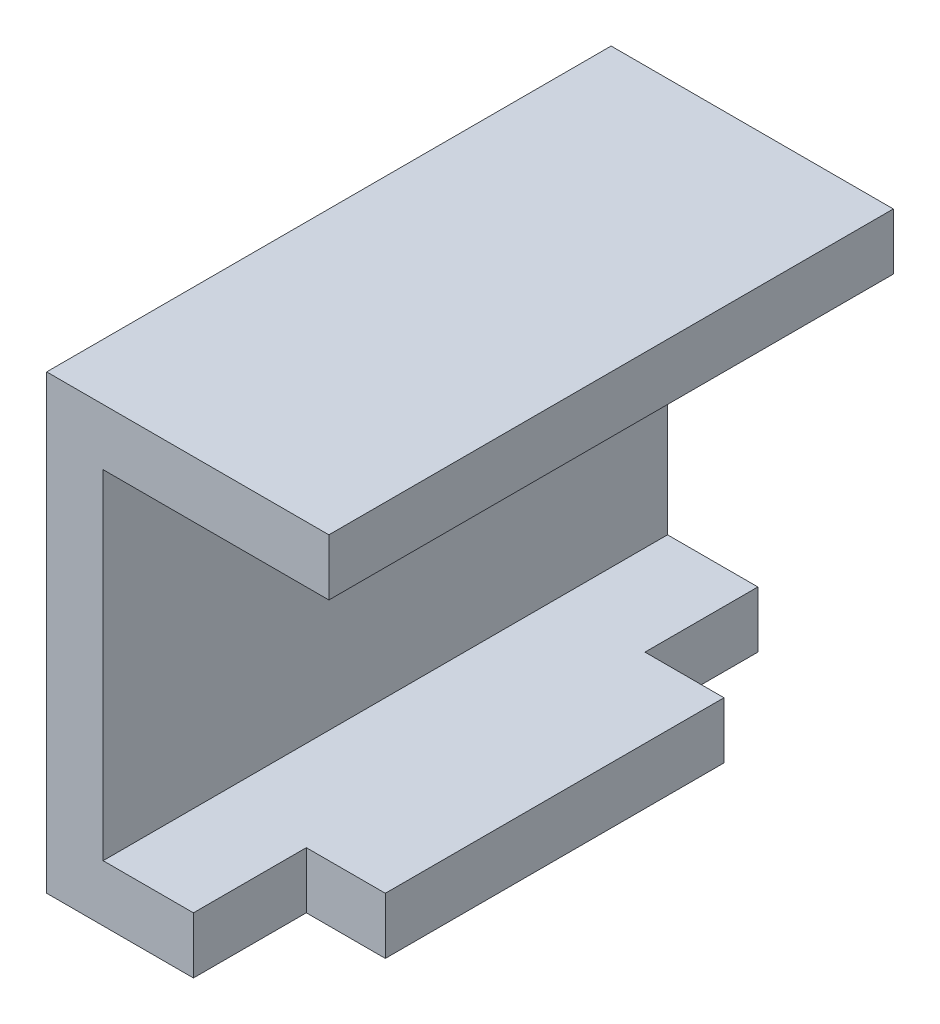
ISO-10303-21;
HEADER;
FILE_DESCRIPTION(('STEP AP214'),'2;1');
FILE_NAME('part.step','',(''),(''),'','','');
FILE_SCHEMA(('AUTOMOTIVE_DESIGN { 1 0 10303 214 1 1 1 1 }'));
ENDSEC;
DATA;
#1=APPLICATION_CONTEXT('core data for automotive mechanical design processes');
#2=APPLICATION_PROTOCOL_DEFINITION('international standard','automotive_design',2000,#1);
#3=PRODUCT_CONTEXT('',#1,'mechanical');
#4=PRODUCT('Part','Part','',(#3));
#5=PRODUCT_RELATED_PRODUCT_CATEGORY('part','',(#4));
#6=PRODUCT_DEFINITION_FORMATION('','',#4);
#7=PRODUCT_DEFINITION_CONTEXT('part definition',#1,'design');
#8=PRODUCT_DEFINITION('design','',#6,#7);
#9=PRODUCT_DEFINITION_SHAPE('','',#8);
#10=(LENGTH_UNIT() NAMED_UNIT(*) SI_UNIT(.MILLI.,.METRE.));
#11=(NAMED_UNIT(*) PLANE_ANGLE_UNIT() SI_UNIT($,.RADIAN.));
#12=(NAMED_UNIT(*) SI_UNIT($,.STERADIAN.) SOLID_ANGLE_UNIT());
#13=UNCERTAINTY_MEASURE_WITH_UNIT(LENGTH_MEASURE(1.E-05),#10,'distance_accuracy_value','');
#14=(GEOMETRIC_REPRESENTATION_CONTEXT(3) GLOBAL_UNCERTAINTY_ASSIGNED_CONTEXT((#13)) GLOBAL_UNIT_ASSIGNED_CONTEXT((#10,
#11,#12)) REPRESENTATION_CONTEXT('',''));
#15=CARTESIAN_POINT('',(0.,0.,0.));
#16=DIRECTION('',(0.,0.,1.));
#17=DIRECTION('',(1.,0.,0.));
#18=AXIS2_PLACEMENT_3D('',#15,#16,#17);
#19=CARTESIAN_POINT('',(0.01333332782721,0.,0.4));
#20=DIRECTION('',(0.,0.,-1.));
#21=DIRECTION('',(0.,-1.,0.));
#22=AXIS2_PLACEMENT_3D('',#19,#20,#21);
#23=PLANE('',#22);
#24=DIRECTION('',(1.,0.,0.));
#25=VECTOR('',#24,1.);
#26=CARTESIAN_POINT('',(0.01333332782721,0.05,0.4));
#27=LINE('',#26,#25);
#28=CARTESIAN_POINT('',(-0.05666667217279,0.05,0.4));
#29=VERTEX_POINT('',#28);
#30=CARTESIAN_POINT('',(0.01333332782721,0.05,0.4));
#31=VERTEX_POINT('',#30);
#32=EDGE_CURVE('E41',#29,#31,#27,.T.);
#33=ORIENTED_EDGE('',*,*,#32,.F.);
#34=DIRECTION('',(0.,1.,0.));
#35=VECTOR('',#34,1.);
#36=CARTESIAN_POINT('',(-0.05666667217279,0.,0.4));
#37=LINE('',#36,#35);
#38=CARTESIAN_POINT('',(-0.05666667217279,0.,0.4));
#39=VERTEX_POINT('',#38);
#40=EDGE_CURVE('E11',#39,#29,#37,.T.);
#41=ORIENTED_EDGE('',*,*,#40,.F.);
#42=DIRECTION('',(-1.,0.,0.));
#43=VECTOR('',#42,1.);
#44=CARTESIAN_POINT('',(-0.08666667217279,0.,0.4));
#45=LINE('',#44,#43);
#46=CARTESIAN_POINT('',(0.01333332782721,0.,0.4));
#47=VERTEX_POINT('',#46);
#48=EDGE_CURVE('E154',#47,#39,#45,.T.);
#49=ORIENTED_EDGE('',*,*,#48,.F.);
#50=DIRECTION('',(0.,-1.,0.));
#51=VECTOR('',#50,1.);
#52=CARTESIAN_POINT('',(0.01333332782721,0.,0.4));
#53=LINE('',#52,#51);
#54=EDGE_CURVE('E197',#31,#47,#53,.T.);
#55=ORIENTED_EDGE('',*,*,#54,.F.);
#56=EDGE_LOOP('',(#33,#41,#49,#55));
#57=FACE_BOUND('',#56,.T.);
#58=ADVANCED_FACE('F17',(#57),#23,.F.);
#59=CARTESIAN_POINT('',(-0.05666667217279,0.,0.4));
#60=DIRECTION('',(-1.,0.,0.));
#61=DIRECTION('',(0.,1.,0.));
#62=AXIS2_PLACEMENT_3D('',#59,#60,#61);
#63=PLANE('',#62);
#64=DIRECTION('',(0.,0.,-1.));
#65=VECTOR('',#64,1.);
#66=CARTESIAN_POINT('',(-0.05666667217279,0.05,0.2));
#67=LINE('',#66,#65);
#68=CARTESIAN_POINT('',(-0.05666667217279,0.05,0.5));
#69=VERTEX_POINT('',#68);
#70=EDGE_CURVE('E201',#69,#29,#67,.T.);
#71=ORIENTED_EDGE('',*,*,#70,.F.);
#72=DIRECTION('',(0.,1.,0.));
#73=VECTOR('',#72,1.);
#74=CARTESIAN_POINT('',(-0.05666667217279,0.10546875,0.5));
#75=LINE('',#74,#73);
#76=CARTESIAN_POINT('',(-0.05666667217279,0.,0.5));
#77=VERTEX_POINT('',#76);
#78=EDGE_CURVE('E217',#77,#69,#75,.T.);
#79=ORIENTED_EDGE('',*,*,#78,.F.);
#80=DIRECTION('',(0.,0.,1.));
#81=VECTOR('',#80,1.);
#82=CARTESIAN_POINT('',(-0.05666667217279,0.,0.2));
#83=LINE('',#82,#81);
#84=EDGE_CURVE('E21',#39,#77,#83,.T.);
#85=ORIENTED_EDGE('',*,*,#84,.F.);
#86=ORIENTED_EDGE('',*,*,#40,.T.);
#87=EDGE_LOOP('',(#71,#79,#85,#86));
#88=FACE_BOUND('',#87,.T.);
#89=ADVANCED_FACE('F303',(#88),#63,.F.);
#90=CARTESIAN_POINT('',(-0.05666667217279,0.,0.1));
#91=DIRECTION('',(0.,0.,1.));
#92=DIRECTION('',(1.,0.,0.));
#93=AXIS2_PLACEMENT_3D('',#90,#91,#92);
#94=PLANE('',#93);
#95=DIRECTION('',(-1.,0.,0.));
#96=VECTOR('',#95,1.);
#97=CARTESIAN_POINT('',(-0.02166667217279,0.05,0.1));
#98=LINE('',#97,#96);
#99=CARTESIAN_POINT('',(0.01333332782721,0.05,0.1));
#100=VERTEX_POINT('',#99);
#101=CARTESIAN_POINT('',(-0.05666667217279,0.05,0.1));
#102=VERTEX_POINT('',#101);
#103=EDGE_CURVE('E228',#100,#102,#98,.T.);
#104=ORIENTED_EDGE('',*,*,#103,.F.);
#105=DIRECTION('',(0.,1.,0.));
#106=VECTOR('',#105,1.);
#107=CARTESIAN_POINT('',(0.01333332782721,0.,0.1));
#108=LINE('',#107,#106);
#109=CARTESIAN_POINT('',(0.01333332782721,0.,0.1));
#110=VERTEX_POINT('',#109);
#111=EDGE_CURVE('E138',#110,#100,#108,.T.);
#112=ORIENTED_EDGE('',*,*,#111,.F.);
#113=DIRECTION('',(1.,0.,0.));
#114=VECTOR('',#113,1.);
#115=CARTESIAN_POINT('',(-0.121666672173,0.,0.1));
#116=LINE('',#115,#114);
#117=CARTESIAN_POINT('',(-0.05666667217279,0.,0.1));
#118=VERTEX_POINT('',#117);
#119=EDGE_CURVE('E133',#118,#110,#116,.T.);
#120=ORIENTED_EDGE('',*,*,#119,.F.);
#121=DIRECTION('',(0.,1.,0.));
#122=VECTOR('',#121,1.);
#123=CARTESIAN_POINT('',(-0.05666667217279,0.,0.1));
#124=LINE('',#123,#122);
#125=EDGE_CURVE('E28',#118,#102,#124,.T.);
#126=ORIENTED_EDGE('',*,*,#125,.T.);
#127=EDGE_LOOP('',(#104,#112,#120,#126));
#128=FACE_BOUND('',#127,.T.);
#129=ADVANCED_FACE('F135',(#128),#94,.F.);
#130=CARTESIAN_POINT('',(-0.05666667217279,0.,0.));
#131=DIRECTION('',(-1.,0.,0.));
#132=DIRECTION('',(0.,1.,0.));
#133=AXIS2_PLACEMENT_3D('',#130,#131,#132);
#134=PLANE('',#133);
#135=DIRECTION('',(0.,0.,-1.));
#136=VECTOR('',#135,1.);
#137=CARTESIAN_POINT('',(-0.05666667217279,0.05,0.));
#138=LINE('',#137,#136);
#139=CARTESIAN_POINT('',(-0.05666667217279,0.05,0.));
#140=VERTEX_POINT('',#139);
#141=EDGE_CURVE('E152',#102,#140,#138,.T.);
#142=ORIENTED_EDGE('',*,*,#141,.F.);
#143=ORIENTED_EDGE('',*,*,#125,.F.);
#144=DIRECTION('',(0.,0.,1.));
#145=VECTOR('',#144,1.);
#146=CARTESIAN_POINT('',(-0.05666667217279,0.,0.));
#147=LINE('',#146,#145);
#148=CARTESIAN_POINT('',(-0.05666667217279,0.,0.));
#149=VERTEX_POINT('',#148);
#150=EDGE_CURVE('E144',#149,#118,#147,.T.);
#151=ORIENTED_EDGE('',*,*,#150,.F.);
#152=DIRECTION('',(0.,-1.,0.));
#153=VECTOR('',#152,1.);
#154=CARTESIAN_POINT('',(-0.05666667217279,0.10546875,0.));
#155=LINE('',#154,#153);
#156=EDGE_CURVE('E210',#140,#149,#155,.T.);
#157=ORIENTED_EDGE('',*,*,#156,.F.);
#158=EDGE_LOOP('',(#142,#143,#151,#157));
#159=FACE_BOUND('',#158,.T.);
#160=ADVANCED_FACE('F149',(#159),#134,.F.);
#161=CARTESIAN_POINT('',(-0.186666672173,0.,0.));
#162=DIRECTION('',(0.,-1.,0.));
#163=DIRECTION('',(0.,0.,-1.));
#164=AXIS2_PLACEMENT_3D('',#161,#162,#163);
#165=PLANE('',#164);
#166=ORIENTED_EDGE('',*,*,#48,.T.);
#167=ORIENTED_EDGE('',*,*,#84,.T.);
#168=DIRECTION('',(1.,0.,0.));
#169=VECTOR('',#168,1.);
#170=CARTESIAN_POINT('',(-0.186666672173,0.,0.5));
#171=LINE('',#170,#169);
#172=CARTESIAN_POINT('',(-0.186666672173,0.,0.5));
#173=VERTEX_POINT('',#172);
#174=EDGE_CURVE('E213',#173,#77,#171,.T.);
#175=ORIENTED_EDGE('',*,*,#174,.F.);
#176=DIRECTION('',(0.,0.,1.));
#177=VECTOR('',#176,1.);
#178=CARTESIAN_POINT('',(-0.186666672173,0.,0.));
#179=LINE('',#178,#177);
#180=CARTESIAN_POINT('',(-0.186666672173,0.,0.));
#181=VERTEX_POINT('',#180);
#182=EDGE_CURVE('E174',#181,#173,#179,.T.);
#183=ORIENTED_EDGE('',*,*,#182,.F.);
#184=DIRECTION('',(1.,0.,0.));
#185=VECTOR('',#184,1.);
#186=CARTESIAN_POINT('',(-0.186666672173,0.,0.));
#187=LINE('',#186,#185);
#188=EDGE_CURVE('E158',#181,#149,#187,.T.);
#189=ORIENTED_EDGE('',*,*,#188,.T.);
#190=ORIENTED_EDGE('',*,*,#150,.T.);
#191=ORIENTED_EDGE('',*,*,#119,.T.);
#192=DIRECTION('',(0.,0.,1.));
#193=VECTOR('',#192,1.);
#194=CARTESIAN_POINT('',(0.01333332782721,0.,0.));
#195=LINE('',#194,#193);
#196=EDGE_CURVE('E145',#110,#47,#195,.T.);
#197=ORIENTED_EDGE('',*,*,#196,.T.);
#198=EDGE_LOOP('',(#166,#167,#175,#183,#189,#190,#191,#197));
#199=FACE_BOUND('',#198,.T.);
#200=ADVANCED_FACE('F156',(#199),#165,.T.);
#201=CARTESIAN_POINT('',(0.01333332782721,0.,0.));
#202=DIRECTION('',(1.,0.,0.));
#203=DIRECTION('',(0.,1.,0.));
#204=AXIS2_PLACEMENT_3D('',#201,#202,#203);
#205=PLANE('',#204);
#206=ORIENTED_EDGE('',*,*,#54,.T.);
#207=ORIENTED_EDGE('',*,*,#196,.F.);
#208=ORIENTED_EDGE('',*,*,#111,.T.);
#209=DIRECTION('',(0.,0.,1.));
#210=VECTOR('',#209,1.);
#211=CARTESIAN_POINT('',(0.01333332782721,0.05,0.));
#212=LINE('',#211,#210);
#213=EDGE_CURVE('E190',#100,#31,#212,.T.);
#214=ORIENTED_EDGE('',*,*,#213,.T.);
#215=EDGE_LOOP('',(#206,#207,#208,#214));
#216=FACE_BOUND('',#215,.T.);
#217=ADVANCED_FACE('F306',(#216),#205,.T.);
#218=CARTESIAN_POINT('',(0.06333332782721,0.35,0.));
#219=DIRECTION('',(1.,0.,0.));
#220=DIRECTION('',(0.,1.,0.));
#221=AXIS2_PLACEMENT_3D('',#218,#219,#220);
#222=PLANE('',#221);
#223=DIRECTION('',(0.,1.,0.));
#224=VECTOR('',#223,1.);
#225=CARTESIAN_POINT('',(0.06333332782721,0.35,0.));
#226=LINE('',#225,#224);
#227=CARTESIAN_POINT('',(0.06333332782721,0.35,0.));
#228=VERTEX_POINT('',#227);
#229=CARTESIAN_POINT('',(0.06333332782721,0.4,0.));
#230=VERTEX_POINT('',#229);
#231=EDGE_CURVE('E186',#228,#230,#226,.T.);
#232=ORIENTED_EDGE('',*,*,#231,.T.);
#233=DIRECTION('',(0.,0.,1.));
#234=VECTOR('',#233,1.);
#235=CARTESIAN_POINT('',(0.06333332782721,0.4,0.));
#236=LINE('',#235,#234);
#237=CARTESIAN_POINT('',(0.06333332782721,0.4,0.5));
#238=VERTEX_POINT('',#237);
#239=EDGE_CURVE('E184',#230,#238,#236,.T.);
#240=ORIENTED_EDGE('',*,*,#239,.T.);
#241=DIRECTION('',(0.,1.,0.));
#242=VECTOR('',#241,1.);
#243=CARTESIAN_POINT('',(0.06333332782721,0.35,0.5));
#244=LINE('',#243,#242);
#245=CARTESIAN_POINT('',(0.06333332782721,0.35,0.5));
#246=VERTEX_POINT('',#245);
#247=EDGE_CURVE('E170',#246,#238,#244,.T.);
#248=ORIENTED_EDGE('',*,*,#247,.F.);
#249=DIRECTION('',(0.,0.,1.));
#250=VECTOR('',#249,1.);
#251=CARTESIAN_POINT('',(0.06333332782721,0.35,0.));
#252=LINE('',#251,#250);
#253=EDGE_CURVE('E185',#228,#246,#252,.T.);
#254=ORIENTED_EDGE('',*,*,#253,.F.);
#255=EDGE_LOOP('',(#232,#240,#248,#254));
#256=FACE_BOUND('',#255,.T.);
#257=ADVANCED_FACE('F288',(#256),#222,.T.);
#258=CARTESIAN_POINT('',(-0.136666672173,0.35,0.));
#259=DIRECTION('',(0.,-1.,0.));
#260=DIRECTION('',(0.,0.,-1.));
#261=AXIS2_PLACEMENT_3D('',#258,#259,#260);
#262=PLANE('',#261);
#263=DIRECTION('',(1.,0.,0.));
#264=VECTOR('',#263,1.);
#265=CARTESIAN_POINT('',(-0.136666672173,0.35,0.));
#266=LINE('',#265,#264);
#267=CARTESIAN_POINT('',(-0.136666672173,0.35,0.));
#268=VERTEX_POINT('',#267);
#269=EDGE_CURVE('E180',#268,#228,#266,.T.);
#270=ORIENTED_EDGE('',*,*,#269,.T.);
#271=ORIENTED_EDGE('',*,*,#253,.T.);
#272=DIRECTION('',(1.,0.,0.));
#273=VECTOR('',#272,1.);
#274=CARTESIAN_POINT('',(-0.136666672173,0.35,0.5));
#275=LINE('',#274,#273);
#276=CARTESIAN_POINT('',(-0.136666672173,0.35,0.5));
#277=VERTEX_POINT('',#276);
#278=EDGE_CURVE('E172',#277,#246,#275,.T.);
#279=ORIENTED_EDGE('',*,*,#278,.F.);
#280=DIRECTION('',(0.,0.,1.));
#281=VECTOR('',#280,1.);
#282=CARTESIAN_POINT('',(-0.136666672173,0.35,0.));
#283=LINE('',#282,#281);
#284=EDGE_CURVE('E227',#268,#277,#283,.T.);
#285=ORIENTED_EDGE('',*,*,#284,.F.);
#286=EDGE_LOOP('',(#270,#271,#279,#285));
#287=FACE_BOUND('',#286,.T.);
#288=ADVANCED_FACE('F286',(#287),#262,.T.);
#289=CARTESIAN_POINT('',(-0.136666672173,0.05,0.));
#290=DIRECTION('',(1.,0.,0.));
#291=DIRECTION('',(0.,1.,0.));
#292=AXIS2_PLACEMENT_3D('',#289,#290,#291);
#293=PLANE('',#292);
#294=DIRECTION('',(0.,1.,0.));
#295=VECTOR('',#294,1.);
#296=CARTESIAN_POINT('',(-0.136666672173,0.05,0.));
#297=LINE('',#296,#295);
#298=CARTESIAN_POINT('',(-0.136666672173,0.05,0.));
#299=VERTEX_POINT('',#298);
#300=EDGE_CURVE('E224',#299,#268,#297,.T.);
#301=ORIENTED_EDGE('',*,*,#300,.T.);
#302=ORIENTED_EDGE('',*,*,#284,.T.);
#303=DIRECTION('',(0.,1.,0.));
#304=VECTOR('',#303,1.);
#305=CARTESIAN_POINT('',(-0.136666672173,0.05,0.5));
#306=LINE('',#305,#304);
#307=CARTESIAN_POINT('',(-0.136666672173,0.05,0.5));
#308=VERTEX_POINT('',#307);
#309=EDGE_CURVE('E232',#308,#277,#306,.T.);
#310=ORIENTED_EDGE('',*,*,#309,.F.);
#311=DIRECTION('',(0.,0.,1.));
#312=VECTOR('',#311,1.);
#313=CARTESIAN_POINT('',(-0.136666672173,0.05,0.));
#314=LINE('',#313,#312);
#315=EDGE_CURVE('E195',#299,#308,#314,.T.);
#316=ORIENTED_EDGE('',*,*,#315,.F.);
#317=EDGE_LOOP('',(#301,#302,#310,#316));
#318=FACE_BOUND('',#317,.T.);
#319=ADVANCED_FACE('F278',(#318),#293,.T.);
#320=CARTESIAN_POINT('',(0.01333332782721,0.05,0.));
#321=DIRECTION('',(0.,1.,0.));
#322=DIRECTION('',(1.,0.,0.));
#323=AXIS2_PLACEMENT_3D('',#320,#321,#322);
#324=PLANE('',#323);
#325=ORIENTED_EDGE('',*,*,#32,.T.);
#326=ORIENTED_EDGE('',*,*,#213,.F.);
#327=ORIENTED_EDGE('',*,*,#103,.T.);
#328=ORIENTED_EDGE('',*,*,#141,.T.);
#329=DIRECTION('',(-1.,0.,0.));
#330=VECTOR('',#329,1.);
#331=CARTESIAN_POINT('',(0.01333332782721,0.05,0.));
#332=LINE('',#331,#330);
#333=EDGE_CURVE('E191',#140,#299,#332,.T.);
#334=ORIENTED_EDGE('',*,*,#333,.T.);
#335=ORIENTED_EDGE('',*,*,#315,.T.);
#336=DIRECTION('',(-1.,0.,0.));
#337=VECTOR('',#336,1.);
#338=CARTESIAN_POINT('',(0.01333332782721,0.05,0.5));
#339=LINE('',#338,#337);
#340=EDGE_CURVE('E220',#69,#308,#339,.T.);
#341=ORIENTED_EDGE('',*,*,#340,.F.);
#342=ORIENTED_EDGE('',*,*,#70,.T.);
#343=EDGE_LOOP('',(#325,#326,#327,#328,#334,#335,#341,#342));
#344=FACE_BOUND('',#343,.T.);
#345=ADVANCED_FACE('F280',(#344),#324,.T.);
#346=CARTESIAN_POINT('',(-0.186666672173,0.4,0.));
#347=DIRECTION('',(-1.,0.,0.));
#348=DIRECTION('',(0.,1.,0.));
#349=AXIS2_PLACEMENT_3D('',#346,#347,#348);
#350=PLANE('',#349);
#351=DIRECTION('',(0.,-1.,0.));
#352=VECTOR('',#351,1.);
#353=CARTESIAN_POINT('',(-0.186666672173,0.4,0.));
#354=LINE('',#353,#352);
#355=CARTESIAN_POINT('',(-0.186666672173,0.4,0.));
#356=VERTEX_POINT('',#355);
#357=EDGE_CURVE('E178',#356,#181,#354,.T.);
#358=ORIENTED_EDGE('',*,*,#357,.T.);
#359=ORIENTED_EDGE('',*,*,#182,.T.);
#360=DIRECTION('',(0.,-1.,0.));
#361=VECTOR('',#360,1.);
#362=CARTESIAN_POINT('',(-0.186666672173,0.4,0.5));
#363=LINE('',#362,#361);
#364=CARTESIAN_POINT('',(-0.186666672173,0.4,0.5));
#365=VERTEX_POINT('',#364);
#366=EDGE_CURVE('E238',#365,#173,#363,.T.);
#367=ORIENTED_EDGE('',*,*,#366,.F.);
#368=DIRECTION('',(0.,0.,1.));
#369=VECTOR('',#368,1.);
#370=CARTESIAN_POINT('',(-0.186666672173,0.4,0.));
#371=LINE('',#370,#369);
#372=EDGE_CURVE('E168',#356,#365,#371,.T.);
#373=ORIENTED_EDGE('',*,*,#372,.F.);
#374=EDGE_LOOP('',(#358,#359,#367,#373));
#375=FACE_BOUND('',#374,.T.);
#376=ADVANCED_FACE('F298',(#375),#350,.T.);
#377=CARTESIAN_POINT('',(0.06333332782721,0.4,0.));
#378=DIRECTION('',(0.,1.,0.));
#379=DIRECTION('',(1.,0.,0.));
#380=AXIS2_PLACEMENT_3D('',#377,#378,#379);
#381=PLANE('',#380);
#382=DIRECTION('',(-1.,0.,0.));
#383=VECTOR('',#382,1.);
#384=CARTESIAN_POINT('',(0.06333332782721,0.4,0.));
#385=LINE('',#384,#383);
#386=EDGE_CURVE('E179',#230,#356,#385,.T.);
#387=ORIENTED_EDGE('',*,*,#386,.T.);
#388=ORIENTED_EDGE('',*,*,#372,.T.);
#389=DIRECTION('',(-1.,0.,0.));
#390=VECTOR('',#389,1.);
#391=CARTESIAN_POINT('',(0.06333332782721,0.4,0.5));
#392=LINE('',#391,#390);
#393=EDGE_CURVE('E173',#238,#365,#392,.T.);
#394=ORIENTED_EDGE('',*,*,#393,.F.);
#395=ORIENTED_EDGE('',*,*,#239,.F.);
#396=EDGE_LOOP('',(#387,#388,#394,#395));
#397=FACE_BOUND('',#396,.T.);
#398=ADVANCED_FACE('F292',(#397),#381,.T.);
#399=CARTESIAN_POINT('',(-0.100729172173,0.2109375,0.5));
#400=DIRECTION('',(0.,0.,1.));
#401=DIRECTION('',(1.,0.,0.));
#402=AXIS2_PLACEMENT_3D('',#399,#400,#401);
#403=PLANE('',#402);
#404=ORIENTED_EDGE('',*,*,#78,.T.);
#405=ORIENTED_EDGE('',*,*,#340,.T.);
#406=ORIENTED_EDGE('',*,*,#309,.T.);
#407=ORIENTED_EDGE('',*,*,#278,.T.);
#408=ORIENTED_EDGE('',*,*,#247,.T.);
#409=ORIENTED_EDGE('',*,*,#393,.T.);
#410=ORIENTED_EDGE('',*,*,#366,.T.);
#411=ORIENTED_EDGE('',*,*,#174,.T.);
#412=EDGE_LOOP('',(#404,#405,#406,#407,#408,#409,#410,#411));
#413=FACE_BOUND('',#412,.T.);
#414=ADVANCED_FACE('F275',(#413),#403,.T.);
#415=CARTESIAN_POINT('',(-0.100729172173,0.2109375,0.));
#416=DIRECTION('',(0.,0.,1.));
#417=DIRECTION('',(1.,0.,0.));
#418=AXIS2_PLACEMENT_3D('',#415,#416,#417);
#419=PLANE('',#418);
#420=ORIENTED_EDGE('',*,*,#156,.T.);
#421=ORIENTED_EDGE('',*,*,#188,.F.);
#422=ORIENTED_EDGE('',*,*,#357,.F.);
#423=ORIENTED_EDGE('',*,*,#386,.F.);
#424=ORIENTED_EDGE('',*,*,#231,.F.);
#425=ORIENTED_EDGE('',*,*,#269,.F.);
#426=ORIENTED_EDGE('',*,*,#300,.F.);
#427=ORIENTED_EDGE('',*,*,#333,.F.);
#428=EDGE_LOOP('',(#420,#421,#422,#423,#424,#425,#426,#427));
#429=FACE_BOUND('',#428,.T.);
#430=ADVANCED_FACE('F19',(#429),#419,.F.);
#431=CLOSED_SHELL('',(#58,#89,#129,#160,#200,#217,#257,#288,#319,#345,#376,#398,#414,#430));
#432=MANIFOLD_SOLID_BREP('B1',#431);
#433=ADVANCED_BREP_SHAPE_REPRESENTATION('',(#18,#432),#14);
#434=SHAPE_DEFINITION_REPRESENTATION(#9,#433);
ENDSEC;
END-ISO-10303-21;
